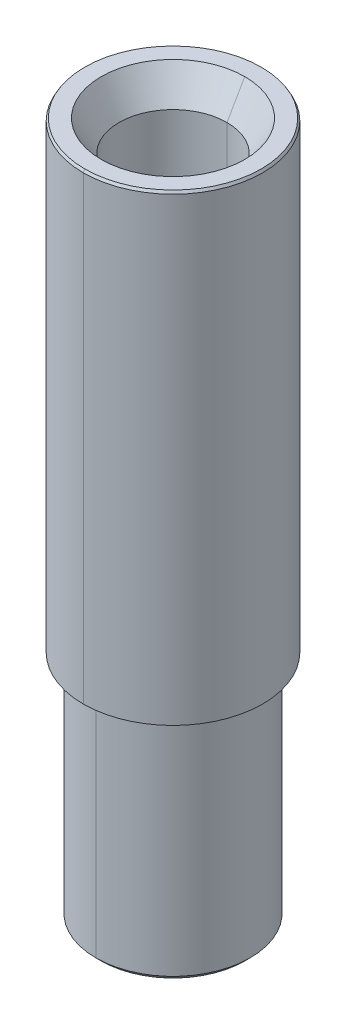
ISO-10303-21;
HEADER;
FILE_DESCRIPTION(('STEP AP214'),'2;1');
FILE_NAME('part.step','',(''),(''),'','','');
FILE_SCHEMA(('AUTOMOTIVE_DESIGN { 1 0 10303 214 1 1 1 1 }'));
ENDSEC;
DATA;
#1=APPLICATION_CONTEXT('core data for automotive mechanical design processes');
#2=APPLICATION_PROTOCOL_DEFINITION('international standard','automotive_design',2000,#1);
#3=PRODUCT_CONTEXT('',#1,'mechanical');
#4=PRODUCT('Part','Part','',(#3));
#5=PRODUCT_RELATED_PRODUCT_CATEGORY('part','',(#4));
#6=PRODUCT_DEFINITION_FORMATION('','',#4);
#7=PRODUCT_DEFINITION_CONTEXT('part definition',#1,'design');
#8=PRODUCT_DEFINITION('design','',#6,#7);
#9=PRODUCT_DEFINITION_SHAPE('','',#8);
#10=(LENGTH_UNIT() NAMED_UNIT(*) SI_UNIT(.MILLI.,.METRE.));
#11=(NAMED_UNIT(*) PLANE_ANGLE_UNIT() SI_UNIT($,.RADIAN.));
#12=(NAMED_UNIT(*) SI_UNIT($,.STERADIAN.) SOLID_ANGLE_UNIT());
#13=UNCERTAINTY_MEASURE_WITH_UNIT(LENGTH_MEASURE(1.E-05),#10,'distance_accuracy_value','');
#14=(GEOMETRIC_REPRESENTATION_CONTEXT(3) GLOBAL_UNCERTAINTY_ASSIGNED_CONTEXT((#13)) GLOBAL_UNIT_ASSIGNED_CONTEXT((#10,
#11,#12)) REPRESENTATION_CONTEXT('',''));
#15=CARTESIAN_POINT('',(0.,0.,0.));
#16=DIRECTION('',(0.,0.,1.));
#17=DIRECTION('',(1.,0.,0.));
#18=AXIS2_PLACEMENT_3D('',#15,#16,#17);
#19=CARTESIAN_POINT('',(0.,18.,0.));
#20=DIRECTION('',(0.,-1.,0.));
#21=DIRECTION('',(0.,0.,-1.));
#22=AXIS2_PLACEMENT_3D('',#19,#20,#21);
#23=CONICAL_SURFACE('',#22,3.43226497308104,0.523598775598314);
#24=DIRECTION('',(0.,-0.866025403784431,0.500000000000013));
#25=VECTOR('',#24,1.);
#26=CARTESIAN_POINT('',(0.,18.,3.43226497308104));
#27=LINE('',#26,#25);
#28=CARTESIAN_POINT('',(0.,18.,3.43226497308104));
#29=VERTEX_POINT('',#28);
#30=CARTESIAN_POINT('',(0.,17.9,3.49));
#31=VERTEX_POINT('',#30);
#32=EDGE_CURVE('E250',#29,#31,#27,.T.);
#33=ORIENTED_EDGE('',*,*,#32,.F.);
#34=CARTESIAN_POINT('',(0.,18.,0.));
#35=DIRECTION('',(0.,1.,0.));
#36=DIRECTION('',(0.,0.,1.));
#37=AXIS2_PLACEMENT_3D('',#34,#35,#36);
#38=CIRCLE('',#37,3.43226497308104);
#39=CARTESIAN_POINT('',(0.,18.,-3.43226497308104));
#40=VERTEX_POINT('',#39);
#41=EDGE_CURVE('E132',#40,#29,#38,.T.);
#42=ORIENTED_EDGE('',*,*,#41,.F.);
#43=DIRECTION('',(0.,-0.866025403784431,-0.500000000000013));
#44=VECTOR('',#43,1.);
#45=CARTESIAN_POINT('',(0.,18.,-3.43226497308104));
#46=LINE('',#45,#44);
#47=CARTESIAN_POINT('',(0.,17.9,-3.49));
#48=VERTEX_POINT('',#47);
#49=EDGE_CURVE('E148',#40,#48,#46,.T.);
#50=ORIENTED_EDGE('',*,*,#49,.T.);
#51=CARTESIAN_POINT('',(0.,17.9,0.));
#52=DIRECTION('',(0.,-1.,0.));
#53=DIRECTION('',(0.,0.,1.));
#54=AXIS2_PLACEMENT_3D('',#51,#52,#53);
#55=CIRCLE('',#54,3.49);
#56=EDGE_CURVE('E200',#31,#48,#55,.T.);
#57=ORIENTED_EDGE('',*,*,#56,.F.);
#58=EDGE_LOOP('',(#33,#42,#50,#57));
#59=FACE_BOUND('',#58,.T.);
#60=ADVANCED_FACE('F17',(#59),#23,.T.);
#61=CARTESIAN_POINT('',(0.,18.,0.));
#62=DIRECTION('',(0.,1.,0.));
#63=DIRECTION('',(0.,0.,1.));
#64=AXIS2_PLACEMENT_3D('',#61,#62,#63);
#65=CONICAL_SURFACE('',#64,2.79282032302755,0.523598775598298);
#66=DIRECTION('',(0.,0.866025403784441,-0.5));
#67=VECTOR('',#66,1.);
#68=CARTESIAN_POINT('',(0.,18.,-2.79282032302755));
#69=LINE('',#68,#67);
#70=CARTESIAN_POINT('',(0.,16.8,-2.1));
#71=VERTEX_POINT('',#70);
#72=CARTESIAN_POINT('',(0.,18.,-2.79282032302755));
#73=VERTEX_POINT('',#72);
#74=EDGE_CURVE('E124',#71,#73,#69,.T.);
#75=ORIENTED_EDGE('',*,*,#74,.F.);
#76=CARTESIAN_POINT('',(0.,16.8,0.));
#77=DIRECTION('',(0.,1.,0.));
#78=DIRECTION('',(0.,0.,1.));
#79=AXIS2_PLACEMENT_3D('',#76,#77,#78);
#80=CIRCLE('',#79,2.1);
#81=CARTESIAN_POINT('',(0.,16.8,2.1));
#82=VERTEX_POINT('',#81);
#83=EDGE_CURVE('E11',#82,#71,#80,.T.);
#84=ORIENTED_EDGE('',*,*,#83,.F.);
#85=DIRECTION('',(0.,0.866025403784441,0.5));
#86=VECTOR('',#85,1.);
#87=CARTESIAN_POINT('',(0.,18.,2.79282032302755));
#88=LINE('',#87,#86);
#89=CARTESIAN_POINT('',(0.,18.,2.79282032302755));
#90=VERTEX_POINT('',#89);
#91=EDGE_CURVE('E127',#82,#90,#88,.T.);
#92=ORIENTED_EDGE('',*,*,#91,.T.);
#93=CARTESIAN_POINT('',(0.,18.,0.));
#94=DIRECTION('',(0.,-1.,0.));
#95=DIRECTION('',(0.,0.,1.));
#96=AXIS2_PLACEMENT_3D('',#93,#94,#95);
#97=CIRCLE('',#96,2.79282032302755);
#98=EDGE_CURVE('E120',#73,#90,#97,.T.);
#99=ORIENTED_EDGE('',*,*,#98,.F.);
#100=EDGE_LOOP('',(#75,#84,#92,#99));
#101=FACE_BOUND('',#100,.T.);
#102=ADVANCED_FACE('F122',(#101),#65,.F.);
#103=CARTESIAN_POINT('',(0.,18.,0.));
#104=DIRECTION('',(0.,-1.,0.));
#105=DIRECTION('',(0.,0.,-1.));
#106=AXIS2_PLACEMENT_3D('',#103,#104,#105);
#107=CYLINDRICAL_SURFACE('',#106,2.1);
#108=DIRECTION('',(0.,-1.,0.));
#109=VECTOR('',#108,1.);
#110=CARTESIAN_POINT('',(0.,18.,2.1));
#111=LINE('',#110,#109);
#112=CARTESIAN_POINT('',(0.,-9.,2.1));
#113=VERTEX_POINT('',#112);
#114=EDGE_CURVE('E154',#82,#113,#111,.T.);
#115=ORIENTED_EDGE('',*,*,#114,.F.);
#116=ORIENTED_EDGE('',*,*,#83,.T.);
#117=DIRECTION('',(0.,-1.,0.));
#118=VECTOR('',#117,1.);
#119=CARTESIAN_POINT('',(0.,18.,-2.1));
#120=LINE('',#119,#118);
#121=CARTESIAN_POINT('',(0.,-9.,-2.1));
#122=VERTEX_POINT('',#121);
#123=EDGE_CURVE('E162',#71,#122,#120,.T.);
#124=ORIENTED_EDGE('',*,*,#123,.T.);
#125=CARTESIAN_POINT('',(0.,-9.,0.));
#126=DIRECTION('',(0.,-1.,0.));
#127=DIRECTION('',(0.,0.,-1.));
#128=AXIS2_PLACEMENT_3D('',#125,#126,#127);
#129=CIRCLE('',#128,2.1);
#130=EDGE_CURVE('E25',#122,#113,#129,.T.);
#131=ORIENTED_EDGE('',*,*,#130,.T.);
#132=EDGE_LOOP('',(#115,#116,#124,#131));
#133=FACE_BOUND('',#132,.T.);
#134=ADVANCED_FACE('F224',(#133),#107,.F.);
#135=CARTESIAN_POINT('',(0.,-0.3,0.));
#136=DIRECTION('',(0.,1.,0.));
#137=DIRECTION('',(0.,0.,1.));
#138=AXIS2_PLACEMENT_3D('',#135,#136,#137);
#139=CONICAL_SURFACE('',#138,3.,0.785398163397441);
#140=DIRECTION('',(0.,0.707106781186553,-0.707106781186542));
#141=VECTOR('',#140,1.);
#142=CARTESIAN_POINT('',(0.,-0.3,-3.));
#143=LINE('',#142,#141);
#144=CARTESIAN_POINT('',(0.,-0.3,-3.));
#145=VERTEX_POINT('',#144);
#146=CARTESIAN_POINT('',(0.,0.,-3.3));
#147=VERTEX_POINT('',#146);
#148=EDGE_CURVE('E237',#145,#147,#143,.T.);
#149=ORIENTED_EDGE('',*,*,#148,.F.);
#150=CARTESIAN_POINT('',(0.,-0.3,0.));
#151=DIRECTION('',(0.,-1.,0.));
#152=DIRECTION('',(0.,0.,1.));
#153=AXIS2_PLACEMENT_3D('',#150,#151,#152);
#154=CIRCLE('',#153,3.);
#155=CARTESIAN_POINT('',(0.,-0.3,3.));
#156=VERTEX_POINT('',#155);
#157=EDGE_CURVE('E212',#156,#145,#154,.T.);
#158=ORIENTED_EDGE('',*,*,#157,.F.);
#159=DIRECTION('',(0.,0.707106781186553,0.707106781186542));
#160=VECTOR('',#159,1.);
#161=CARTESIAN_POINT('',(0.,-0.3,3.));
#162=LINE('',#161,#160);
#163=CARTESIAN_POINT('',(0.,0.,3.3));
#164=VERTEX_POINT('',#163);
#165=EDGE_CURVE('E163',#156,#164,#162,.T.);
#166=ORIENTED_EDGE('',*,*,#165,.T.);
#167=CARTESIAN_POINT('',(0.,0.,0.));
#168=DIRECTION('',(0.,1.,0.));
#169=DIRECTION('',(0.,0.,1.));
#170=AXIS2_PLACEMENT_3D('',#167,#168,#169);
#171=CIRCLE('',#170,3.3);
#172=EDGE_CURVE('E131',#147,#164,#171,.T.);
#173=ORIENTED_EDGE('',*,*,#172,.F.);
#174=EDGE_LOOP('',(#149,#158,#166,#173));
#175=FACE_BOUND('',#174,.T.);
#176=ADVANCED_FACE('F298',(#175),#139,.T.);
#177=CARTESIAN_POINT('',(0.,-9.,0.));
#178=DIRECTION('',(0.,1.,0.));
#179=DIRECTION('',(0.,0.,1.));
#180=AXIS2_PLACEMENT_3D('',#177,#178,#179);
#181=CONICAL_SURFACE('',#180,2.8,0.785398163397453);
#182=DIRECTION('',(0.,0.707106781186544,-0.707106781186551));
#183=VECTOR('',#182,1.);
#184=CARTESIAN_POINT('',(0.,-9.,-2.8));
#185=LINE('',#184,#183);
#186=CARTESIAN_POINT('',(0.,-9.,-2.8));
#187=VERTEX_POINT('',#186);
#188=CARTESIAN_POINT('',(0.,-8.8,-3.));
#189=VERTEX_POINT('',#188);
#190=EDGE_CURVE('E169',#187,#189,#185,.T.);
#191=ORIENTED_EDGE('',*,*,#190,.F.);
#192=CARTESIAN_POINT('',(0.,-9.,0.));
#193=DIRECTION('',(0.,-1.,0.));
#194=DIRECTION('',(0.,0.,-1.));
#195=AXIS2_PLACEMENT_3D('',#192,#193,#194);
#196=CIRCLE('',#195,2.8);
#197=CARTESIAN_POINT('',(0.,-9.,2.8));
#198=VERTEX_POINT('',#197);
#199=EDGE_CURVE('E215',#198,#187,#196,.T.);
#200=ORIENTED_EDGE('',*,*,#199,.F.);
#201=DIRECTION('',(0.,0.707106781186544,0.707106781186551));
#202=VECTOR('',#201,1.);
#203=CARTESIAN_POINT('',(0.,-9.,2.8));
#204=LINE('',#203,#202);
#205=CARTESIAN_POINT('',(0.,-8.8,3.));
#206=VERTEX_POINT('',#205);
#207=EDGE_CURVE('E177',#198,#206,#204,.T.);
#208=ORIENTED_EDGE('',*,*,#207,.T.);
#209=CARTESIAN_POINT('',(0.,-8.8,0.));
#210=DIRECTION('',(0.,1.,0.));
#211=DIRECTION('',(0.,0.,-1.));
#212=AXIS2_PLACEMENT_3D('',#209,#210,#211);
#213=CIRCLE('',#212,3.);
#214=EDGE_CURVE('E209',#189,#206,#213,.T.);
#215=ORIENTED_EDGE('',*,*,#214,.F.);
#216=EDGE_LOOP('',(#191,#200,#208,#215));
#217=FACE_BOUND('',#216,.T.);
#218=ADVANCED_FACE('F326',(#217),#181,.T.);
#219=CARTESIAN_POINT('',(0.,-9.,0.));
#220=DIRECTION('',(0.,-1.,0.));
#221=DIRECTION('',(0.,0.,-1.));
#222=AXIS2_PLACEMENT_3D('',#219,#220,#221);
#223=PLANE('',#222);
#224=ORIENTED_EDGE('',*,*,#130,.F.);
#225=CARTESIAN_POINT('',(0.,-9.,0.));
#226=DIRECTION('',(0.,-1.,0.));
#227=DIRECTION('',(0.,0.,-1.));
#228=AXIS2_PLACEMENT_3D('',#225,#226,#227);
#229=CIRCLE('',#228,2.1);
#230=EDGE_CURVE('E158',#113,#122,#229,.T.);
#231=ORIENTED_EDGE('',*,*,#230,.F.);
#232=EDGE_LOOP('',(#224,#231));
#233=FACE_BOUND('',#232,.T.);
#234=ORIENTED_EDGE('',*,*,#199,.T.);
#235=CARTESIAN_POINT('',(0.,-9.,0.));
#236=DIRECTION('',(0.,-1.,0.));
#237=DIRECTION('',(0.,0.,-1.));
#238=AXIS2_PLACEMENT_3D('',#235,#236,#237);
#239=CIRCLE('',#238,2.8);
#240=EDGE_CURVE('E167',#187,#198,#239,.T.);
#241=ORIENTED_EDGE('',*,*,#240,.T.);
#242=EDGE_LOOP('',(#234,#241));
#243=FACE_BOUND('',#242,.T.);
#244=ADVANCED_FACE('F227',(#233,#243),#223,.T.);
#245=CARTESIAN_POINT('',(0.,-9.,0.));
#246=DIRECTION('',(0.,1.,0.));
#247=DIRECTION('',(0.,0.,1.));
#248=AXIS2_PLACEMENT_3D('',#245,#246,#247);
#249=CYLINDRICAL_SURFACE('',#248,3.);
#250=DIRECTION('',(0.,1.,0.));
#251=VECTOR('',#250,1.);
#252=CARTESIAN_POINT('',(0.,-9.,-3.));
#253=LINE('',#252,#251);
#254=EDGE_CURVE('E181',#189,#145,#253,.T.);
#255=ORIENTED_EDGE('',*,*,#254,.F.);
#256=ORIENTED_EDGE('',*,*,#214,.T.);
#257=DIRECTION('',(0.,1.,0.));
#258=VECTOR('',#257,1.);
#259=CARTESIAN_POINT('',(0.,-9.,3.));
#260=LINE('',#259,#258);
#261=EDGE_CURVE('E185',#206,#156,#260,.T.);
#262=ORIENTED_EDGE('',*,*,#261,.T.);
#263=ORIENTED_EDGE('',*,*,#157,.T.);
#264=EDGE_LOOP('',(#255,#256,#262,#263));
#265=FACE_BOUND('',#264,.T.);
#266=ADVANCED_FACE('F278',(#265),#249,.T.);
#267=CARTESIAN_POINT('',(0.,0.,0.));
#268=DIRECTION('',(0.,1.,0.));
#269=DIRECTION('',(1.,0.,0.));
#270=AXIS2_PLACEMENT_3D('',#267,#268,#269);
#271=PLANE('',#270);
#272=CARTESIAN_POINT('',(0.,0.,0.));
#273=DIRECTION('',(0.,1.,0.));
#274=DIRECTION('',(0.,0.,1.));
#275=AXIS2_PLACEMENT_3D('',#272,#273,#274);
#276=CIRCLE('',#275,3.3);
#277=EDGE_CURVE('E168',#164,#147,#276,.T.);
#278=ORIENTED_EDGE('',*,*,#277,.T.);
#279=ORIENTED_EDGE('',*,*,#172,.T.);
#280=EDGE_LOOP('',(#278,#279));
#281=FACE_BOUND('',#280,.T.);
#282=CARTESIAN_POINT('',(0.,0.,0.));
#283=DIRECTION('',(0.,1.,0.));
#284=DIRECTION('',(0.,0.,1.));
#285=AXIS2_PLACEMENT_3D('',#282,#283,#284);
#286=CIRCLE('',#285,3.49);
#287=CARTESIAN_POINT('',(0.,0.,-3.49));
#288=VERTEX_POINT('',#287);
#289=CARTESIAN_POINT('',(0.,0.,3.49));
#290=VERTEX_POINT('',#289);
#291=EDGE_CURVE('E37',#288,#290,#286,.T.);
#292=ORIENTED_EDGE('',*,*,#291,.F.);
#293=CARTESIAN_POINT('',(0.,0.,0.));
#294=DIRECTION('',(0.,1.,0.));
#295=DIRECTION('',(0.,0.,1.));
#296=AXIS2_PLACEMENT_3D('',#293,#294,#295);
#297=CIRCLE('',#296,3.49);
#298=EDGE_CURVE('E193',#290,#288,#297,.T.);
#299=ORIENTED_EDGE('',*,*,#298,.F.);
#300=EDGE_LOOP('',(#292,#299));
#301=FACE_BOUND('',#300,.T.);
#302=ADVANCED_FACE('F276',(#281,#301),#271,.F.);
#303=CARTESIAN_POINT('',(0.,18.,0.));
#304=DIRECTION('',(0.,1.,0.));
#305=DIRECTION('',(1.,0.,0.));
#306=AXIS2_PLACEMENT_3D('',#303,#304,#305);
#307=PLANE('',#306);
#308=CARTESIAN_POINT('',(0.,18.,0.));
#309=DIRECTION('',(0.,-1.,0.));
#310=DIRECTION('',(0.,0.,1.));
#311=AXIS2_PLACEMENT_3D('',#308,#309,#310);
#312=CIRCLE('',#311,2.79282032302755);
#313=EDGE_CURVE('E134',#90,#73,#312,.T.);
#314=ORIENTED_EDGE('',*,*,#313,.T.);
#315=ORIENTED_EDGE('',*,*,#98,.T.);
#316=EDGE_LOOP('',(#314,#315));
#317=FACE_BOUND('',#316,.T.);
#318=ORIENTED_EDGE('',*,*,#41,.T.);
#319=CARTESIAN_POINT('',(0.,18.,0.));
#320=DIRECTION('',(0.,1.,0.));
#321=DIRECTION('',(0.,0.,1.));
#322=AXIS2_PLACEMENT_3D('',#319,#320,#321);
#323=CIRCLE('',#322,3.43226497308104);
#324=EDGE_CURVE('E254',#29,#40,#323,.T.);
#325=ORIENTED_EDGE('',*,*,#324,.T.);
#326=EDGE_LOOP('',(#318,#325));
#327=FACE_BOUND('',#326,.T.);
#328=ADVANCED_FACE('F135',(#317,#327),#307,.T.);
#329=CARTESIAN_POINT('',(0.,18.,0.));
#330=DIRECTION('',(0.,-1.,0.));
#331=DIRECTION('',(0.,0.,-1.));
#332=AXIS2_PLACEMENT_3D('',#329,#330,#331);
#333=CYLINDRICAL_SURFACE('',#332,3.49);
#334=DIRECTION('',(0.,-1.,0.));
#335=VECTOR('',#334,1.);
#336=CARTESIAN_POINT('',(0.,18.,3.49));
#337=LINE('',#336,#335);
#338=EDGE_CURVE('E189',#31,#290,#337,.T.);
#339=ORIENTED_EDGE('',*,*,#338,.F.);
#340=ORIENTED_EDGE('',*,*,#56,.T.);
#341=DIRECTION('',(0.,-1.,0.));
#342=VECTOR('',#341,1.);
#343=CARTESIAN_POINT('',(0.,18.,-3.49));
#344=LINE('',#343,#342);
#345=EDGE_CURVE('E197',#48,#288,#344,.T.);
#346=ORIENTED_EDGE('',*,*,#345,.T.);
#347=ORIENTED_EDGE('',*,*,#291,.T.);
#348=EDGE_LOOP('',(#339,#340,#346,#347));
#349=FACE_BOUND('',#348,.T.);
#350=ADVANCED_FACE('F273',(#349),#333,.T.);
#351=CARTESIAN_POINT('',(0.,18.,0.));
#352=DIRECTION('',(0.,-1.,0.));
#353=DIRECTION('',(0.,0.,-1.));
#354=AXIS2_PLACEMENT_3D('',#351,#352,#353);
#355=CYLINDRICAL_SURFACE('',#354,3.49);
#356=CARTESIAN_POINT('',(0.,17.9,0.));
#357=DIRECTION('',(0.,-1.,0.));
#358=DIRECTION('',(0.,0.,1.));
#359=AXIS2_PLACEMENT_3D('',#356,#357,#358);
#360=CIRCLE('',#359,3.49);
#361=EDGE_CURVE('E243',#48,#31,#360,.T.);
#362=ORIENTED_EDGE('',*,*,#361,.T.);
#363=ORIENTED_EDGE('',*,*,#338,.T.);
#364=ORIENTED_EDGE('',*,*,#298,.T.);
#365=ORIENTED_EDGE('',*,*,#345,.F.);
#366=EDGE_LOOP('',(#362,#363,#364,#365));
#367=FACE_BOUND('',#366,.T.);
#368=ADVANCED_FACE('F275',(#367),#355,.T.);
#369=CARTESIAN_POINT('',(0.,-9.,0.));
#370=DIRECTION('',(0.,1.,0.));
#371=DIRECTION('',(0.,0.,1.));
#372=AXIS2_PLACEMENT_3D('',#369,#370,#371);
#373=CYLINDRICAL_SURFACE('',#372,3.);
#374=CARTESIAN_POINT('',(0.,-8.8,0.));
#375=DIRECTION('',(0.,1.,0.));
#376=DIRECTION('',(0.,0.,-1.));
#377=AXIS2_PLACEMENT_3D('',#374,#375,#376);
#378=CIRCLE('',#377,3.);
#379=EDGE_CURVE('E173',#206,#189,#378,.T.);
#380=ORIENTED_EDGE('',*,*,#379,.T.);
#381=ORIENTED_EDGE('',*,*,#254,.T.);
#382=CARTESIAN_POINT('',(0.,-0.3,0.));
#383=DIRECTION('',(0.,-1.,0.));
#384=DIRECTION('',(0.,0.,1.));
#385=AXIS2_PLACEMENT_3D('',#382,#383,#384);
#386=CIRCLE('',#385,3.);
#387=EDGE_CURVE('E232',#145,#156,#386,.T.);
#388=ORIENTED_EDGE('',*,*,#387,.T.);
#389=ORIENTED_EDGE('',*,*,#261,.F.);
#390=EDGE_LOOP('',(#380,#381,#388,#389));
#391=FACE_BOUND('',#390,.T.);
#392=ADVANCED_FACE('F319',(#391),#373,.T.);
#393=CARTESIAN_POINT('',(0.,-9.,0.));
#394=DIRECTION('',(0.,1.,0.));
#395=DIRECTION('',(0.,0.,1.));
#396=AXIS2_PLACEMENT_3D('',#393,#394,#395);
#397=CONICAL_SURFACE('',#396,2.8,0.785398163397453);
#398=ORIENTED_EDGE('',*,*,#240,.F.);
#399=ORIENTED_EDGE('',*,*,#190,.T.);
#400=ORIENTED_EDGE('',*,*,#379,.F.);
#401=ORIENTED_EDGE('',*,*,#207,.F.);
#402=EDGE_LOOP('',(#398,#399,#400,#401));
#403=FACE_BOUND('',#402,.T.);
#404=ADVANCED_FACE('F311',(#403),#397,.T.);
#405=CARTESIAN_POINT('',(0.,-0.3,0.));
#406=DIRECTION('',(0.,1.,0.));
#407=DIRECTION('',(0.,0.,1.));
#408=AXIS2_PLACEMENT_3D('',#405,#406,#407);
#409=CONICAL_SURFACE('',#408,3.,0.785398163397441);
#410=ORIENTED_EDGE('',*,*,#387,.F.);
#411=ORIENTED_EDGE('',*,*,#148,.T.);
#412=ORIENTED_EDGE('',*,*,#277,.F.);
#413=ORIENTED_EDGE('',*,*,#165,.F.);
#414=EDGE_LOOP('',(#410,#411,#412,#413));
#415=FACE_BOUND('',#414,.T.);
#416=ADVANCED_FACE('F307',(#415),#409,.T.);
#417=CARTESIAN_POINT('',(0.,18.,0.));
#418=DIRECTION('',(0.,-1.,0.));
#419=DIRECTION('',(0.,0.,-1.));
#420=AXIS2_PLACEMENT_3D('',#417,#418,#419);
#421=CYLINDRICAL_SURFACE('',#420,2.1);
#422=CARTESIAN_POINT('',(0.,16.8,0.));
#423=DIRECTION('',(0.,1.,0.));
#424=DIRECTION('',(0.,0.,1.));
#425=AXIS2_PLACEMENT_3D('',#422,#423,#424);
#426=CIRCLE('',#425,2.1);
#427=EDGE_CURVE('E142',#71,#82,#426,.T.);
#428=ORIENTED_EDGE('',*,*,#427,.T.);
#429=ORIENTED_EDGE('',*,*,#114,.T.);
#430=ORIENTED_EDGE('',*,*,#230,.T.);
#431=ORIENTED_EDGE('',*,*,#123,.F.);
#432=EDGE_LOOP('',(#428,#429,#430,#431));
#433=FACE_BOUND('',#432,.T.);
#434=ADVANCED_FACE('F230',(#433),#421,.F.);
#435=CARTESIAN_POINT('',(0.,18.,0.));
#436=DIRECTION('',(0.,1.,0.));
#437=DIRECTION('',(0.,0.,1.));
#438=AXIS2_PLACEMENT_3D('',#435,#436,#437);
#439=CONICAL_SURFACE('',#438,2.79282032302755,0.523598775598298);
#440=ORIENTED_EDGE('',*,*,#427,.F.);
#441=ORIENTED_EDGE('',*,*,#74,.T.);
#442=ORIENTED_EDGE('',*,*,#313,.F.);
#443=ORIENTED_EDGE('',*,*,#91,.F.);
#444=EDGE_LOOP('',(#440,#441,#442,#443));
#445=FACE_BOUND('',#444,.T.);
#446=ADVANCED_FACE('F140',(#445),#439,.F.);
#447=CARTESIAN_POINT('',(0.,18.,0.));
#448=DIRECTION('',(0.,-1.,0.));
#449=DIRECTION('',(0.,0.,-1.));
#450=AXIS2_PLACEMENT_3D('',#447,#448,#449);
#451=CONICAL_SURFACE('',#450,3.43226497308104,0.523598775598314);
#452=ORIENTED_EDGE('',*,*,#324,.F.);
#453=ORIENTED_EDGE('',*,*,#32,.T.);
#454=ORIENTED_EDGE('',*,*,#361,.F.);
#455=ORIENTED_EDGE('',*,*,#49,.F.);
#456=EDGE_LOOP('',(#452,#453,#454,#455));
#457=FACE_BOUND('',#456,.T.);
#458=ADVANCED_FACE('F269',(#457),#451,.T.);
#459=CLOSED_SHELL('',(#60,#102,#134,#176,#218,#244,#266,#302,#328,#350,#368,#392,#404,#416,#434,
#446,#458));
#460=MANIFOLD_SOLID_BREP('B1',#459);
#461=ADVANCED_BREP_SHAPE_REPRESENTATION('',(#18,#460),#14);
#462=SHAPE_DEFINITION_REPRESENTATION(#9,#461);
ENDSEC;
END-ISO-10303-21;
